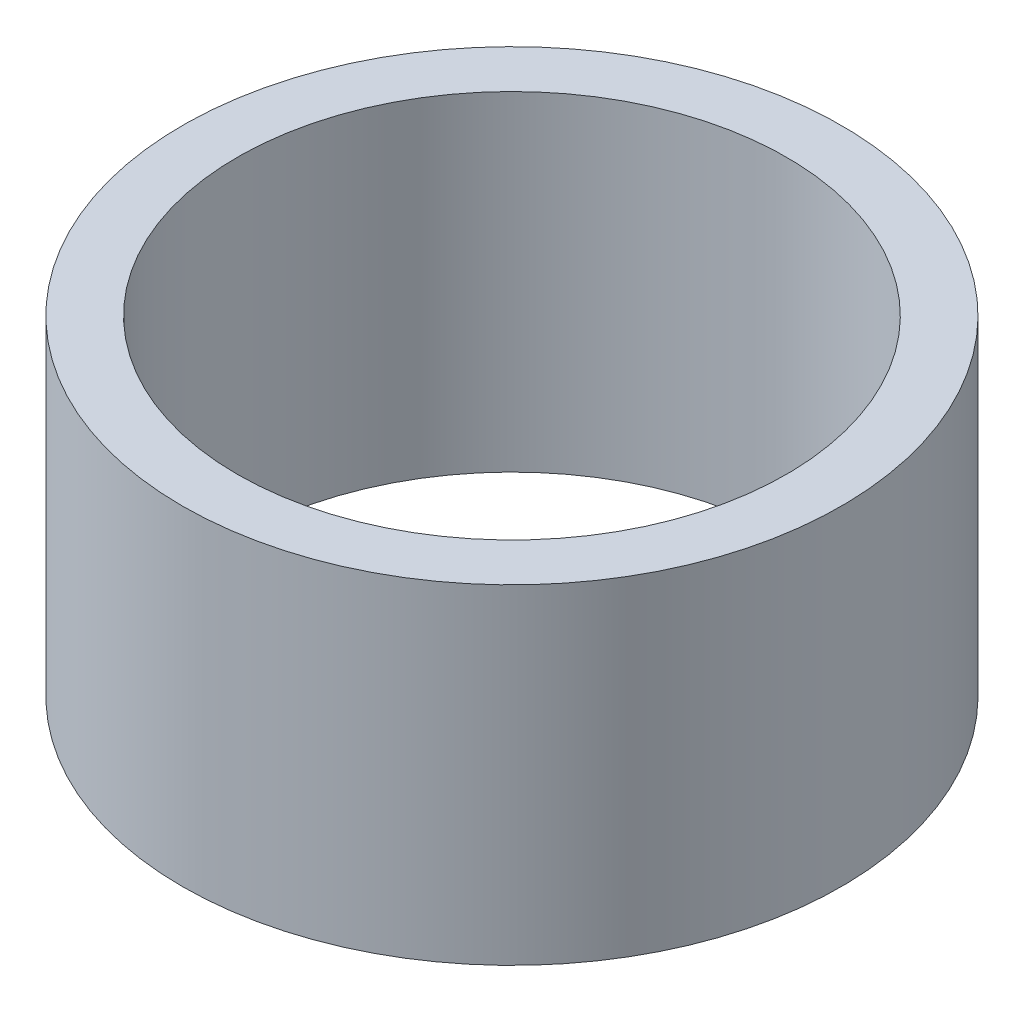
ISO-10303-21;
HEADER;
FILE_DESCRIPTION(('STEP AP214'),'2;1');
FILE_NAME('part.step','',(''),(''),'','','');
FILE_SCHEMA(('AUTOMOTIVE_DESIGN { 1 0 10303 214 1 1 1 1 }'));
ENDSEC;
DATA;
#1=APPLICATION_CONTEXT('core data for automotive mechanical design processes');
#2=APPLICATION_PROTOCOL_DEFINITION('international standard','automotive_design',2000,#1);
#3=PRODUCT_CONTEXT('',#1,'mechanical');
#4=PRODUCT('Part','Part','',(#3));
#5=PRODUCT_RELATED_PRODUCT_CATEGORY('part','',(#4));
#6=PRODUCT_DEFINITION_FORMATION('','',#4);
#7=PRODUCT_DEFINITION_CONTEXT('part definition',#1,'design');
#8=PRODUCT_DEFINITION('design','',#6,#7);
#9=PRODUCT_DEFINITION_SHAPE('','',#8);
#10=(LENGTH_UNIT() NAMED_UNIT(*) SI_UNIT(.MILLI.,.METRE.));
#11=(NAMED_UNIT(*) PLANE_ANGLE_UNIT() SI_UNIT($,.RADIAN.));
#12=(NAMED_UNIT(*) SI_UNIT($,.STERADIAN.) SOLID_ANGLE_UNIT());
#13=UNCERTAINTY_MEASURE_WITH_UNIT(LENGTH_MEASURE(1.E-05),#10,'distance_accuracy_value','');
#14=(GEOMETRIC_REPRESENTATION_CONTEXT(3) GLOBAL_UNCERTAINTY_ASSIGNED_CONTEXT((#13)) GLOBAL_UNIT_ASSIGNED_CONTEXT((#10,
#11,#12)) REPRESENTATION_CONTEXT('',''));
#15=CARTESIAN_POINT('',(0.,0.,0.));
#16=DIRECTION('',(0.,0.,1.));
#17=DIRECTION('',(1.,0.,0.));
#18=AXIS2_PLACEMENT_3D('',#15,#16,#17);
#19=CARTESIAN_POINT('',(0.,6.,0.));
#20=DIRECTION('',(0.,1.,0.));
#21=DIRECTION('',(0.,0.,1.));
#22=AXIS2_PLACEMENT_3D('',#19,#20,#21);
#23=PLANE('',#22);
#24=CARTESIAN_POINT('',(0.,6.,0.));
#25=DIRECTION('',(0.,1.,0.));
#26=DIRECTION('',(0.,0.,1.));
#27=AXIS2_PLACEMENT_3D('',#24,#25,#26);
#28=CIRCLE('',#27,6.);
#29=CARTESIAN_POINT('',(0.,6.,6.));
#30=VERTEX_POINT('',#29);
#31=EDGE_CURVE('E10',#30,#30,#28,.T.);
#32=ORIENTED_EDGE('',*,*,#31,.T.);
#33=EDGE_LOOP('',(#32));
#34=FACE_BOUND('',#33,.T.);
#35=CARTESIAN_POINT('',(0.,6.,0.));
#36=DIRECTION('',(0.,1.,0.));
#37=DIRECTION('',(0.,0.,1.));
#38=AXIS2_PLACEMENT_3D('',#35,#36,#37);
#39=CIRCLE('',#38,5.);
#40=CARTESIAN_POINT('',(0.,6.,5.));
#41=VERTEX_POINT('',#40);
#42=EDGE_CURVE('E43',#41,#41,#39,.T.);
#43=ORIENTED_EDGE('',*,*,#42,.F.);
#44=EDGE_LOOP('',(#43));
#45=FACE_BOUND('',#44,.T.);
#46=ADVANCED_FACE('F32',(#34,#45),#23,.T.);
#47=CARTESIAN_POINT('',(0.,0.,0.));
#48=DIRECTION('',(0.,1.,0.));
#49=DIRECTION('',(0.,0.,1.));
#50=AXIS2_PLACEMENT_3D('',#47,#48,#49);
#51=PLANE('',#50);
#52=CARTESIAN_POINT('',(0.,0.,0.));
#53=DIRECTION('',(0.,1.,0.));
#54=DIRECTION('',(0.,0.,1.));
#55=AXIS2_PLACEMENT_3D('',#52,#53,#54);
#56=CIRCLE('',#55,6.);
#57=CARTESIAN_POINT('',(0.,0.,6.));
#58=VERTEX_POINT('',#57);
#59=EDGE_CURVE('E36',#58,#58,#56,.T.);
#60=ORIENTED_EDGE('',*,*,#59,.F.);
#61=EDGE_LOOP('',(#60));
#62=FACE_BOUND('',#61,.T.);
#63=CARTESIAN_POINT('',(0.,0.,0.));
#64=DIRECTION('',(0.,1.,0.));
#65=DIRECTION('',(0.,0.,1.));
#66=AXIS2_PLACEMENT_3D('',#63,#64,#65);
#67=CIRCLE('',#66,5.);
#68=CARTESIAN_POINT('',(0.,0.,5.));
#69=VERTEX_POINT('',#68);
#70=EDGE_CURVE('E45',#69,#69,#67,.T.);
#71=ORIENTED_EDGE('',*,*,#70,.T.);
#72=EDGE_LOOP('',(#71));
#73=FACE_BOUND('',#72,.T.);
#74=ADVANCED_FACE('F55',(#62,#73),#51,.F.);
#75=CARTESIAN_POINT('',(0.,6.,0.));
#76=DIRECTION('',(0.,-1.,0.));
#77=DIRECTION('',(0.,0.,-1.));
#78=AXIS2_PLACEMENT_3D('',#75,#76,#77);
#79=CYLINDRICAL_SURFACE('',#78,6.);
#80=ORIENTED_EDGE('',*,*,#31,.F.);
#81=EDGE_LOOP('',(#80));
#82=FACE_BOUND('',#81,.T.);
#83=ORIENTED_EDGE('',*,*,#59,.T.);
#84=EDGE_LOOP('',(#83));
#85=FACE_BOUND('',#84,.T.);
#86=ADVANCED_FACE('F34',(#82,#85),#79,.T.);
#87=CARTESIAN_POINT('',(0.,6.,0.));
#88=DIRECTION('',(0.,-1.,0.));
#89=DIRECTION('',(0.,0.,-1.));
#90=AXIS2_PLACEMENT_3D('',#87,#88,#89);
#91=CYLINDRICAL_SURFACE('',#90,5.);
#92=ORIENTED_EDGE('',*,*,#42,.T.);
#93=EDGE_LOOP('',(#92));
#94=FACE_BOUND('',#93,.T.);
#95=ORIENTED_EDGE('',*,*,#70,.F.);
#96=EDGE_LOOP('',(#95));
#97=FACE_BOUND('',#96,.T.);
#98=ADVANCED_FACE('F51',(#94,#97),#91,.F.);
#99=CLOSED_SHELL('',(#46,#74,#86,#98));
#100=MANIFOLD_SOLID_BREP('B2',#99);
#101=ADVANCED_BREP_SHAPE_REPRESENTATION('',(#18,#100),#14);
#102=SHAPE_DEFINITION_REPRESENTATION(#9,#101);
ENDSEC;
END-ISO-10303-21;
